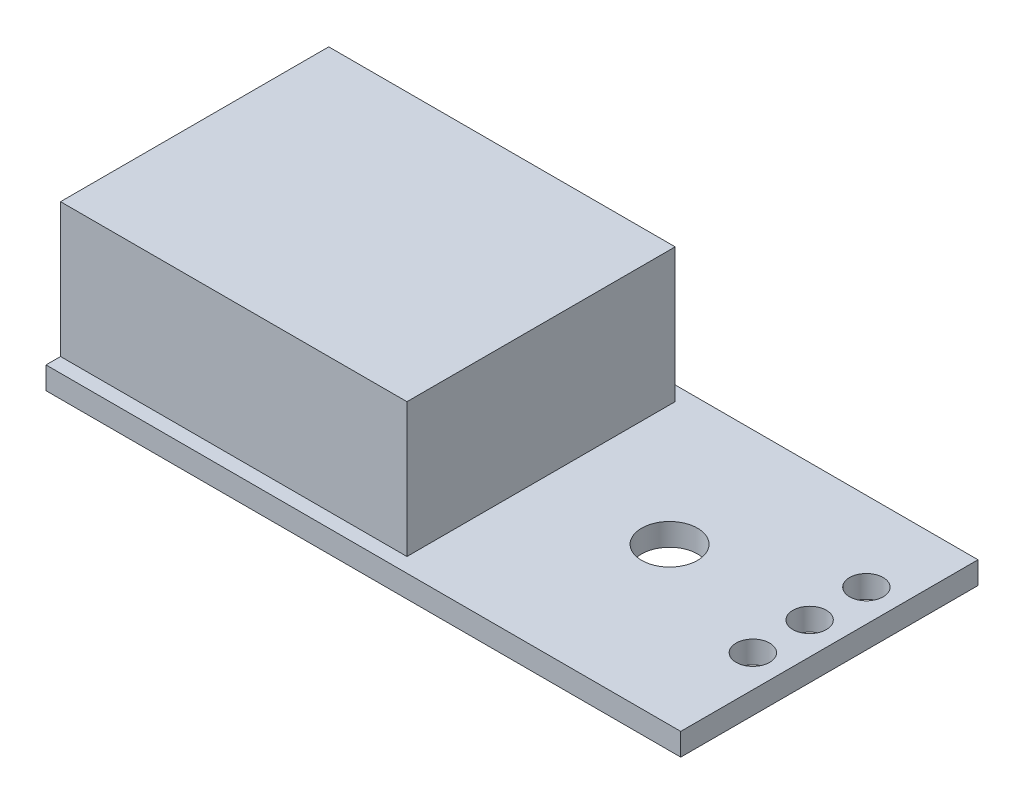
ISO-10303-21;
HEADER;
FILE_DESCRIPTION(('STEP AP214'),'2;1');
FILE_NAME('part.step','',(''),(''),'','','');
FILE_SCHEMA(('AUTOMOTIVE_DESIGN { 1 0 10303 214 1 1 1 1 }'));
ENDSEC;
DATA;
#1=APPLICATION_CONTEXT('core data for automotive mechanical design processes');
#2=APPLICATION_PROTOCOL_DEFINITION('international standard','automotive_design',2000,#1);
#3=PRODUCT_CONTEXT('',#1,'mechanical');
#4=PRODUCT('Part','Part','',(#3));
#5=PRODUCT_RELATED_PRODUCT_CATEGORY('part','',(#4));
#6=PRODUCT_DEFINITION_FORMATION('','',#4);
#7=PRODUCT_DEFINITION_CONTEXT('part definition',#1,'design');
#8=PRODUCT_DEFINITION('design','',#6,#7);
#9=PRODUCT_DEFINITION_SHAPE('','',#8);
#10=(LENGTH_UNIT() NAMED_UNIT(*) SI_UNIT(.MILLI.,.METRE.));
#11=(NAMED_UNIT(*) PLANE_ANGLE_UNIT() SI_UNIT($,.RADIAN.));
#12=(NAMED_UNIT(*) SI_UNIT($,.STERADIAN.) SOLID_ANGLE_UNIT());
#13=UNCERTAINTY_MEASURE_WITH_UNIT(LENGTH_MEASURE(1.E-05),#10,'distance_accuracy_value','');
#14=(GEOMETRIC_REPRESENTATION_CONTEXT(3) GLOBAL_UNCERTAINTY_ASSIGNED_CONTEXT((#13)) GLOBAL_UNIT_ASSIGNED_CONTEXT((#10,
#11,#12)) REPRESENTATION_CONTEXT('',''));
#15=CARTESIAN_POINT('',(0.,0.,0.));
#16=DIRECTION('',(0.,0.,1.));
#17=DIRECTION('',(1.,0.,0.));
#18=AXIS2_PLACEMENT_3D('',#15,#16,#17);
#19=CARTESIAN_POINT('',(12.7652894750192,0.,1.98872040411754));
#20=DIRECTION('',(0.,1.,0.));
#21=DIRECTION('',(0.,0.,1.));
#22=AXIS2_PLACEMENT_3D('',#19,#20,#21);
#23=CYLINDRICAL_SURFACE('',#22,0.75);
#24=CARTESIAN_POINT('',(12.7652894750192,0.,1.98872040411754));
#25=DIRECTION('',(0.,1.,0.));
#26=DIRECTION('',(0.,0.,1.));
#27=AXIS2_PLACEMENT_3D('',#24,#25,#26);
#28=CIRCLE('',#27,0.75);
#29=CARTESIAN_POINT('',(12.7652894750192,0.,2.73872040411754));
#30=VERTEX_POINT('',#29);
#31=EDGE_CURVE('E42',#30,#30,#28,.T.);
#32=ORIENTED_EDGE('',*,*,#31,.F.);
#33=EDGE_LOOP('',(#32));
#34=FACE_BOUND('',#33,.T.);
#35=CARTESIAN_POINT('',(12.7652894750192,1.,1.98872040411754));
#36=DIRECTION('',(0.,1.,0.));
#37=DIRECTION('',(0.,0.,1.));
#38=AXIS2_PLACEMENT_3D('',#35,#36,#37);
#39=CIRCLE('',#38,0.75);
#40=CARTESIAN_POINT('',(12.7652894750192,1.,2.73872040411754));
#41=VERTEX_POINT('',#40);
#42=EDGE_CURVE('E11',#41,#41,#39,.T.);
#43=ORIENTED_EDGE('',*,*,#42,.T.);
#44=EDGE_LOOP('',(#43));
#45=FACE_BOUND('',#44,.T.);
#46=ADVANCED_FACE('F35',(#34,#45),#23,.F.);
#47=CARTESIAN_POINT('',(0.,1.,0.));
#48=DIRECTION('',(0.,1.,0.));
#49=DIRECTION('',(0.,0.,1.));
#50=AXIS2_PLACEMENT_3D('',#47,#48,#49);
#51=PLANE('',#50);
#52=CARTESIAN_POINT('',(12.7652894750192,1.,-0.551279595882464));
#53=DIRECTION('',(0.,1.,0.));
#54=DIRECTION('',(0.,0.,1.));
#55=AXIS2_PLACEMENT_3D('',#52,#53,#54);
#56=CIRCLE('',#55,0.75);
#57=CARTESIAN_POINT('',(12.7652894750192,1.,0.198720404117537));
#58=VERTEX_POINT('',#57);
#59=EDGE_CURVE('E334',#58,#58,#56,.T.);
#60=ORIENTED_EDGE('',*,*,#59,.F.);
#61=EDGE_LOOP('',(#60));
#62=FACE_BOUND('',#61,.T.);
#63=CARTESIAN_POINT('',(12.7652894750192,1.,-3.09127959588246));
#64=DIRECTION('',(0.,1.,0.));
#65=DIRECTION('',(0.,0.,1.));
#66=AXIS2_PLACEMENT_3D('',#63,#64,#65);
#67=CIRCLE('',#66,0.75);
#68=CARTESIAN_POINT('',(12.7652894750192,1.,-2.34127959588246));
#69=VERTEX_POINT('',#68);
#70=EDGE_CURVE('E335',#69,#69,#67,.T.);
#71=ORIENTED_EDGE('',*,*,#70,.F.);
#72=EDGE_LOOP('',(#71));
#73=FACE_BOUND('',#72,.T.);
#74=CARTESIAN_POINT('',(6.7,1.,-0.349999999999997));
#75=DIRECTION('',(0.,1.,0.));
#76=DIRECTION('',(0.,0.,1.));
#77=AXIS2_PLACEMENT_3D('',#74,#75,#76);
#78=CIRCLE('',#77,1.25);
#79=CARTESIAN_POINT('',(6.7,1.,0.900000000000002));
#80=VERTEX_POINT('',#79);
#81=EDGE_CURVE('E146',#80,#80,#78,.T.);
#82=ORIENTED_EDGE('',*,*,#81,.F.);
#83=EDGE_LOOP('',(#82));
#84=FACE_BOUND('',#83,.T.);
#85=DIRECTION('',(0.,0.,1.));
#86=VECTOR('',#85,1.);
#87=CARTESIAN_POINT('',(-14.2,1.,-6.65));
#88=LINE('',#87,#86);
#89=CARTESIAN_POINT('',(-14.2,1.,-6.65));
#90=VERTEX_POINT('',#89);
#91=CARTESIAN_POINT('',(-14.2,1.,-5.99999999999999));
#92=VERTEX_POINT('',#91);
#93=EDGE_CURVE('E157',#90,#92,#88,.T.);
#94=ORIENTED_EDGE('',*,*,#93,.T.);
#95=DIRECTION('',(1.,0.,0.));
#96=VECTOR('',#95,1.);
#97=CARTESIAN_POINT('',(0.,1.,-6.));
#98=LINE('',#97,#96);
#99=CARTESIAN_POINT('',(1.3,1.,-6.));
#100=VERTEX_POINT('',#99);
#101=EDGE_CURVE('E134',#92,#100,#98,.T.);
#102=ORIENTED_EDGE('',*,*,#101,.T.);
#103=DIRECTION('',(0.,0.,1.));
#104=VECTOR('',#103,1.);
#105=CARTESIAN_POINT('',(1.3,1.,0.));
#106=LINE('',#105,#104);
#107=CARTESIAN_POINT('',(1.3,1.,6.));
#108=VERTEX_POINT('',#107);
#109=EDGE_CURVE('E135',#100,#108,#106,.T.);
#110=ORIENTED_EDGE('',*,*,#109,.T.);
#111=DIRECTION('',(-1.,0.,0.));
#112=VECTOR('',#111,1.);
#113=CARTESIAN_POINT('',(0.,1.,6.));
#114=LINE('',#113,#112);
#115=CARTESIAN_POINT('',(-14.2,1.,6.));
#116=VERTEX_POINT('',#115);
#117=EDGE_CURVE('E138',#108,#116,#114,.T.);
#118=ORIENTED_EDGE('',*,*,#117,.T.);
#119=CARTESIAN_POINT('',(-14.2,1.,6.65));
#120=VERTEX_POINT('',#119);
#121=EDGE_CURVE('E156',#116,#120,#88,.T.);
#122=ORIENTED_EDGE('',*,*,#121,.T.);
#123=DIRECTION('',(1.,0.,0.));
#124=VECTOR('',#123,1.);
#125=CARTESIAN_POINT('',(-14.2,1.,6.65));
#126=LINE('',#125,#124);
#127=CARTESIAN_POINT('',(14.2,1.,6.65));
#128=VERTEX_POINT('',#127);
#129=EDGE_CURVE('E58',#120,#128,#126,.T.);
#130=ORIENTED_EDGE('',*,*,#129,.T.);
#131=DIRECTION('',(0.,0.,-1.));
#132=VECTOR('',#131,1.);
#133=CARTESIAN_POINT('',(14.2,1.,-6.65));
#134=LINE('',#133,#132);
#135=CARTESIAN_POINT('',(14.2,1.,-6.65));
#136=VERTEX_POINT('',#135);
#137=EDGE_CURVE('E153',#128,#136,#134,.T.);
#138=ORIENTED_EDGE('',*,*,#137,.T.);
#139=DIRECTION('',(-1.,0.,0.));
#140=VECTOR('',#139,1.);
#141=CARTESIAN_POINT('',(-14.2,1.,-6.65));
#142=LINE('',#141,#140);
#143=EDGE_CURVE('E87',#136,#90,#142,.T.);
#144=ORIENTED_EDGE('',*,*,#143,.T.);
#145=EDGE_LOOP('',(#94,#102,#110,#118,#122,#130,#138,#144));
#146=FACE_BOUND('',#145,.T.);
#147=ORIENTED_EDGE('',*,*,#42,.F.);
#148=EDGE_LOOP('',(#147));
#149=FACE_BOUND('',#148,.T.);
#150=ADVANCED_FACE('F182',(#62,#73,#84,#146,#149),#51,.T.);
#151=CARTESIAN_POINT('',(14.2,1.,-6.65));
#152=DIRECTION('',(-1.,0.,0.));
#153=DIRECTION('',(0.,0.,1.));
#154=AXIS2_PLACEMENT_3D('',#151,#152,#153);
#155=PLANE('',#154);
#156=DIRECTION('',(0.,0.,-1.));
#157=VECTOR('',#156,1.);
#158=CARTESIAN_POINT('',(14.2,0.,-6.65));
#159=LINE('',#158,#157);
#160=CARTESIAN_POINT('',(14.2,0.,6.65));
#161=VERTEX_POINT('',#160);
#162=CARTESIAN_POINT('',(14.2,0.,-6.65));
#163=VERTEX_POINT('',#162);
#164=EDGE_CURVE('E150',#161,#163,#159,.T.);
#165=ORIENTED_EDGE('',*,*,#164,.T.);
#166=DIRECTION('',(0.,-1.,0.));
#167=VECTOR('',#166,1.);
#168=CARTESIAN_POINT('',(14.2,1.,-6.65));
#169=LINE('',#168,#167);
#170=EDGE_CURVE('E174',#136,#163,#169,.T.);
#171=ORIENTED_EDGE('',*,*,#170,.F.);
#172=ORIENTED_EDGE('',*,*,#137,.F.);
#173=DIRECTION('',(0.,-1.,0.));
#174=VECTOR('',#173,1.);
#175=CARTESIAN_POINT('',(14.2,1.,6.65));
#176=LINE('',#175,#174);
#177=EDGE_CURVE('E160',#128,#161,#176,.T.);
#178=ORIENTED_EDGE('',*,*,#177,.T.);
#179=EDGE_LOOP('',(#165,#171,#172,#178));
#180=FACE_BOUND('',#179,.T.);
#181=ADVANCED_FACE('F186',(#180),#155,.F.);
#182=CARTESIAN_POINT('',(-14.2,1.,-6.65));
#183=DIRECTION('',(0.,0.,1.));
#184=DIRECTION('',(1.,0.,0.));
#185=AXIS2_PLACEMENT_3D('',#182,#183,#184);
#186=PLANE('',#185);
#187=DIRECTION('',(-1.,0.,0.));
#188=VECTOR('',#187,1.);
#189=CARTESIAN_POINT('',(-14.2,0.,-6.65));
#190=LINE('',#189,#188);
#191=CARTESIAN_POINT('',(-14.2,0.,-6.65));
#192=VERTEX_POINT('',#191);
#193=EDGE_CURVE('E163',#163,#192,#190,.T.);
#194=ORIENTED_EDGE('',*,*,#193,.T.);
#195=DIRECTION('',(0.,-1.,0.));
#196=VECTOR('',#195,1.);
#197=CARTESIAN_POINT('',(-14.2,1.,-6.65));
#198=LINE('',#197,#196);
#199=EDGE_CURVE('E171',#90,#192,#198,.T.);
#200=ORIENTED_EDGE('',*,*,#199,.F.);
#201=ORIENTED_EDGE('',*,*,#143,.F.);
#202=ORIENTED_EDGE('',*,*,#170,.T.);
#203=EDGE_LOOP('',(#194,#200,#201,#202));
#204=FACE_BOUND('',#203,.T.);
#205=ADVANCED_FACE('F192',(#204),#186,.F.);
#206=CARTESIAN_POINT('',(-14.2,1.,-6.65));
#207=DIRECTION('',(1.,0.,0.));
#208=DIRECTION('',(0.,0.,-1.));
#209=AXIS2_PLACEMENT_3D('',#206,#207,#208);
#210=PLANE('',#209);
#211=DIRECTION('',(0.,0.,1.));
#212=VECTOR('',#211,1.);
#213=CARTESIAN_POINT('',(-14.2,0.,-6.65));
#214=LINE('',#213,#212);
#215=CARTESIAN_POINT('',(-14.2,0.,6.65));
#216=VERTEX_POINT('',#215);
#217=EDGE_CURVE('E165',#192,#216,#214,.T.);
#218=ORIENTED_EDGE('',*,*,#217,.T.);
#219=DIRECTION('',(0.,-1.,0.));
#220=VECTOR('',#219,1.);
#221=CARTESIAN_POINT('',(-14.2,1.,6.65));
#222=LINE('',#221,#220);
#223=EDGE_CURVE('E169',#120,#216,#222,.T.);
#224=ORIENTED_EDGE('',*,*,#223,.F.);
#225=ORIENTED_EDGE('',*,*,#121,.F.);
#226=DIRECTION('',(0.,-1.,0.));
#227=VECTOR('',#226,1.);
#228=CARTESIAN_POINT('',(-14.2,7.,6.));
#229=LINE('',#228,#227);
#230=CARTESIAN_POINT('',(-14.2,7.,6.));
#231=VERTEX_POINT('',#230);
#232=EDGE_CURVE('E118',#231,#116,#229,.T.);
#233=ORIENTED_EDGE('',*,*,#232,.F.);
#234=DIRECTION('',(0.,0.,1.));
#235=VECTOR('',#234,1.);
#236=CARTESIAN_POINT('',(-14.2,7.,0.));
#237=LINE('',#236,#235);
#238=CARTESIAN_POINT('',(-14.2,7.,-5.99999999999999));
#239=VERTEX_POINT('',#238);
#240=EDGE_CURVE('E110',#239,#231,#237,.T.);
#241=ORIENTED_EDGE('',*,*,#240,.F.);
#242=DIRECTION('',(0.,-1.,0.));
#243=VECTOR('',#242,1.);
#244=CARTESIAN_POINT('',(-14.2,7.,-5.99999999999999));
#245=LINE('',#244,#243);
#246=EDGE_CURVE('E115',#239,#92,#245,.T.);
#247=ORIENTED_EDGE('',*,*,#246,.T.);
#248=ORIENTED_EDGE('',*,*,#93,.F.);
#249=ORIENTED_EDGE('',*,*,#199,.T.);
#250=EDGE_LOOP('',(#218,#224,#225,#233,#241,#247,#248,#249));
#251=FACE_BOUND('',#250,.T.);
#252=ADVANCED_FACE('F112',(#251),#210,.F.);
#253=CARTESIAN_POINT('',(-14.2,1.,6.65));
#254=DIRECTION('',(0.,0.,-1.));
#255=DIRECTION('',(-1.,0.,0.));
#256=AXIS2_PLACEMENT_3D('',#253,#254,#255);
#257=PLANE('',#256);
#258=DIRECTION('',(1.,0.,0.));
#259=VECTOR('',#258,1.);
#260=CARTESIAN_POINT('',(-14.2,0.,6.65));
#261=LINE('',#260,#259);
#262=EDGE_CURVE('E79',#216,#161,#261,.T.);
#263=ORIENTED_EDGE('',*,*,#262,.T.);
#264=ORIENTED_EDGE('',*,*,#177,.F.);
#265=ORIENTED_EDGE('',*,*,#129,.F.);
#266=ORIENTED_EDGE('',*,*,#223,.T.);
#267=EDGE_LOOP('',(#263,#264,#265,#266));
#268=FACE_BOUND('',#267,.T.);
#269=ADVANCED_FACE('F202',(#268),#257,.F.);
#270=CARTESIAN_POINT('',(0.,0.,0.));
#271=DIRECTION('',(0.,1.,0.));
#272=DIRECTION('',(0.,0.,1.));
#273=AXIS2_PLACEMENT_3D('',#270,#271,#272);
#274=PLANE('',#273);
#275=CARTESIAN_POINT('',(12.7652894750192,0.,-0.551279595882464));
#276=DIRECTION('',(0.,1.,0.));
#277=DIRECTION('',(0.,0.,1.));
#278=AXIS2_PLACEMENT_3D('',#275,#276,#277);
#279=CIRCLE('',#278,0.75);
#280=CARTESIAN_POINT('',(12.7652894750192,0.,0.198720404117537));
#281=VERTEX_POINT('',#280);
#282=EDGE_CURVE('E332',#281,#281,#279,.T.);
#283=ORIENTED_EDGE('',*,*,#282,.T.);
#284=EDGE_LOOP('',(#283));
#285=FACE_BOUND('',#284,.T.);
#286=CARTESIAN_POINT('',(12.7652894750192,0.,-3.09127959588246));
#287=DIRECTION('',(0.,1.,0.));
#288=DIRECTION('',(0.,0.,1.));
#289=AXIS2_PLACEMENT_3D('',#286,#287,#288);
#290=CIRCLE('',#289,0.75);
#291=CARTESIAN_POINT('',(12.7652894750192,0.,-2.34127959588246));
#292=VERTEX_POINT('',#291);
#293=EDGE_CURVE('E130',#292,#292,#290,.T.);
#294=ORIENTED_EDGE('',*,*,#293,.T.);
#295=EDGE_LOOP('',(#294));
#296=FACE_BOUND('',#295,.T.);
#297=ORIENTED_EDGE('',*,*,#262,.F.);
#298=ORIENTED_EDGE('',*,*,#217,.F.);
#299=ORIENTED_EDGE('',*,*,#193,.F.);
#300=ORIENTED_EDGE('',*,*,#164,.F.);
#301=EDGE_LOOP('',(#297,#298,#299,#300));
#302=FACE_BOUND('',#301,.T.);
#303=CARTESIAN_POINT('',(6.7,0.,-0.349999999999997));
#304=DIRECTION('',(0.,1.,0.));
#305=DIRECTION('',(0.,0.,1.));
#306=AXIS2_PLACEMENT_3D('',#303,#304,#305);
#307=CIRCLE('',#306,1.25);
#308=CARTESIAN_POINT('',(6.7,0.,0.900000000000002));
#309=VERTEX_POINT('',#308);
#310=EDGE_CURVE('E147',#309,#309,#307,.T.);
#311=ORIENTED_EDGE('',*,*,#310,.T.);
#312=EDGE_LOOP('',(#311));
#313=FACE_BOUND('',#312,.T.);
#314=ORIENTED_EDGE('',*,*,#31,.T.);
#315=EDGE_LOOP('',(#314));
#316=FACE_BOUND('',#315,.T.);
#317=ADVANCED_FACE('F178',(#285,#296,#302,#313,#316),#274,.F.);
#318=CARTESIAN_POINT('',(6.7,0.,-0.349999999999997));
#319=DIRECTION('',(0.,1.,0.));
#320=DIRECTION('',(0.,0.,1.));
#321=AXIS2_PLACEMENT_3D('',#318,#319,#320);
#322=CYLINDRICAL_SURFACE('',#321,1.25);
#323=ORIENTED_EDGE('',*,*,#310,.F.);
#324=EDGE_LOOP('',(#323));
#325=FACE_BOUND('',#324,.T.);
#326=ORIENTED_EDGE('',*,*,#81,.T.);
#327=EDGE_LOOP('',(#326));
#328=FACE_BOUND('',#327,.T.);
#329=ADVANCED_FACE('F198',(#325,#328),#322,.F.);
#330=CARTESIAN_POINT('',(0.,7.,-6.));
#331=DIRECTION('',(0.,0.,1.));
#332=DIRECTION('',(1.,0.,0.));
#333=AXIS2_PLACEMENT_3D('',#330,#331,#332);
#334=PLANE('',#333);
#335=ORIENTED_EDGE('',*,*,#101,.F.);
#336=ORIENTED_EDGE('',*,*,#246,.F.);
#337=DIRECTION('',(-1.,0.,0.));
#338=VECTOR('',#337,1.);
#339=CARTESIAN_POINT('',(0.,7.,-6.));
#340=LINE('',#339,#338);
#341=CARTESIAN_POINT('',(1.3,7.,-6.));
#342=VERTEX_POINT('',#341);
#343=EDGE_CURVE('E122',#342,#239,#340,.T.);
#344=ORIENTED_EDGE('',*,*,#343,.F.);
#345=DIRECTION('',(0.,-1.,0.));
#346=VECTOR('',#345,1.);
#347=CARTESIAN_POINT('',(1.3,7.,-6.));
#348=LINE('',#347,#346);
#349=EDGE_CURVE('E221',#342,#100,#348,.T.);
#350=ORIENTED_EDGE('',*,*,#349,.T.);
#351=EDGE_LOOP('',(#335,#336,#344,#350));
#352=FACE_BOUND('',#351,.T.);
#353=ADVANCED_FACE('F132',(#352),#334,.F.);
#354=CARTESIAN_POINT('',(0.,7.,6.));
#355=DIRECTION('',(0.,0.,-1.));
#356=DIRECTION('',(-1.,0.,0.));
#357=AXIS2_PLACEMENT_3D('',#354,#355,#356);
#358=PLANE('',#357);
#359=ORIENTED_EDGE('',*,*,#117,.F.);
#360=DIRECTION('',(0.,-1.,0.));
#361=VECTOR('',#360,1.);
#362=CARTESIAN_POINT('',(1.3,7.,6.));
#363=LINE('',#362,#361);
#364=CARTESIAN_POINT('',(1.3,7.,6.));
#365=VERTEX_POINT('',#364);
#366=EDGE_CURVE('E49',#365,#108,#363,.T.);
#367=ORIENTED_EDGE('',*,*,#366,.F.);
#368=DIRECTION('',(1.,0.,0.));
#369=VECTOR('',#368,1.);
#370=CARTESIAN_POINT('',(0.,7.,6.));
#371=LINE('',#370,#369);
#372=EDGE_CURVE('E121',#231,#365,#371,.T.);
#373=ORIENTED_EDGE('',*,*,#372,.F.);
#374=ORIENTED_EDGE('',*,*,#232,.T.);
#375=EDGE_LOOP('',(#359,#367,#373,#374));
#376=FACE_BOUND('',#375,.T.);
#377=ADVANCED_FACE('F219',(#376),#358,.F.);
#378=CARTESIAN_POINT('',(1.3,7.,0.));
#379=DIRECTION('',(-1.,0.,0.));
#380=DIRECTION('',(0.,0.,1.));
#381=AXIS2_PLACEMENT_3D('',#378,#379,#380);
#382=PLANE('',#381);
#383=ORIENTED_EDGE('',*,*,#109,.F.);
#384=ORIENTED_EDGE('',*,*,#349,.F.);
#385=DIRECTION('',(0.,0.,-1.));
#386=VECTOR('',#385,1.);
#387=CARTESIAN_POINT('',(1.3,7.,0.));
#388=LINE('',#387,#386);
#389=EDGE_CURVE('E126',#365,#342,#388,.T.);
#390=ORIENTED_EDGE('',*,*,#389,.F.);
#391=ORIENTED_EDGE('',*,*,#366,.T.);
#392=EDGE_LOOP('',(#383,#384,#390,#391));
#393=FACE_BOUND('',#392,.T.);
#394=ADVANCED_FACE('F224',(#393),#382,.F.);
#395=CARTESIAN_POINT('',(0.,7.,0.));
#396=DIRECTION('',(0.,1.,0.));
#397=DIRECTION('',(0.,0.,1.));
#398=AXIS2_PLACEMENT_3D('',#395,#396,#397);
#399=PLANE('',#398);
#400=ORIENTED_EDGE('',*,*,#343,.T.);
#401=ORIENTED_EDGE('',*,*,#240,.T.);
#402=ORIENTED_EDGE('',*,*,#372,.T.);
#403=ORIENTED_EDGE('',*,*,#389,.T.);
#404=EDGE_LOOP('',(#400,#401,#402,#403));
#405=FACE_BOUND('',#404,.T.);
#406=ADVANCED_FACE('F125',(#405),#399,.T.);
#407=CARTESIAN_POINT('',(12.7652894750192,0.,-3.09127959588246));
#408=DIRECTION('',(0.,1.,0.));
#409=DIRECTION('',(0.,0.,1.));
#410=AXIS2_PLACEMENT_3D('',#407,#408,#409);
#411=CYLINDRICAL_SURFACE('',#410,0.75);
#412=ORIENTED_EDGE('',*,*,#293,.F.);
#413=EDGE_LOOP('',(#412));
#414=FACE_BOUND('',#413,.T.);
#415=ORIENTED_EDGE('',*,*,#70,.T.);
#416=EDGE_LOOP('',(#415));
#417=FACE_BOUND('',#416,.T.);
#418=ADVANCED_FACE('F231',(#414,#417),#411,.F.);
#419=CARTESIAN_POINT('',(12.7652894750192,0.,-0.551279595882464));
#420=DIRECTION('',(0.,1.,0.));
#421=DIRECTION('',(0.,0.,1.));
#422=AXIS2_PLACEMENT_3D('',#419,#420,#421);
#423=CYLINDRICAL_SURFACE('',#422,0.75);
#424=ORIENTED_EDGE('',*,*,#282,.F.);
#425=EDGE_LOOP('',(#424));
#426=FACE_BOUND('',#425,.T.);
#427=ORIENTED_EDGE('',*,*,#59,.T.);
#428=EDGE_LOOP('',(#427));
#429=FACE_BOUND('',#428,.T.);
#430=ADVANCED_FACE('F290',(#426,#429),#423,.F.);
#431=CLOSED_SHELL('',(#46,#150,#181,#205,#252,#269,#317,#329,#353,#377,#394,#406,#418,#430));
#432=MANIFOLD_SOLID_BREP('B2',#431);
#433=ADVANCED_BREP_SHAPE_REPRESENTATION('',(#18,#432),#14);
#434=SHAPE_DEFINITION_REPRESENTATION(#9,#433);
ENDSEC;
END-ISO-10303-21;
